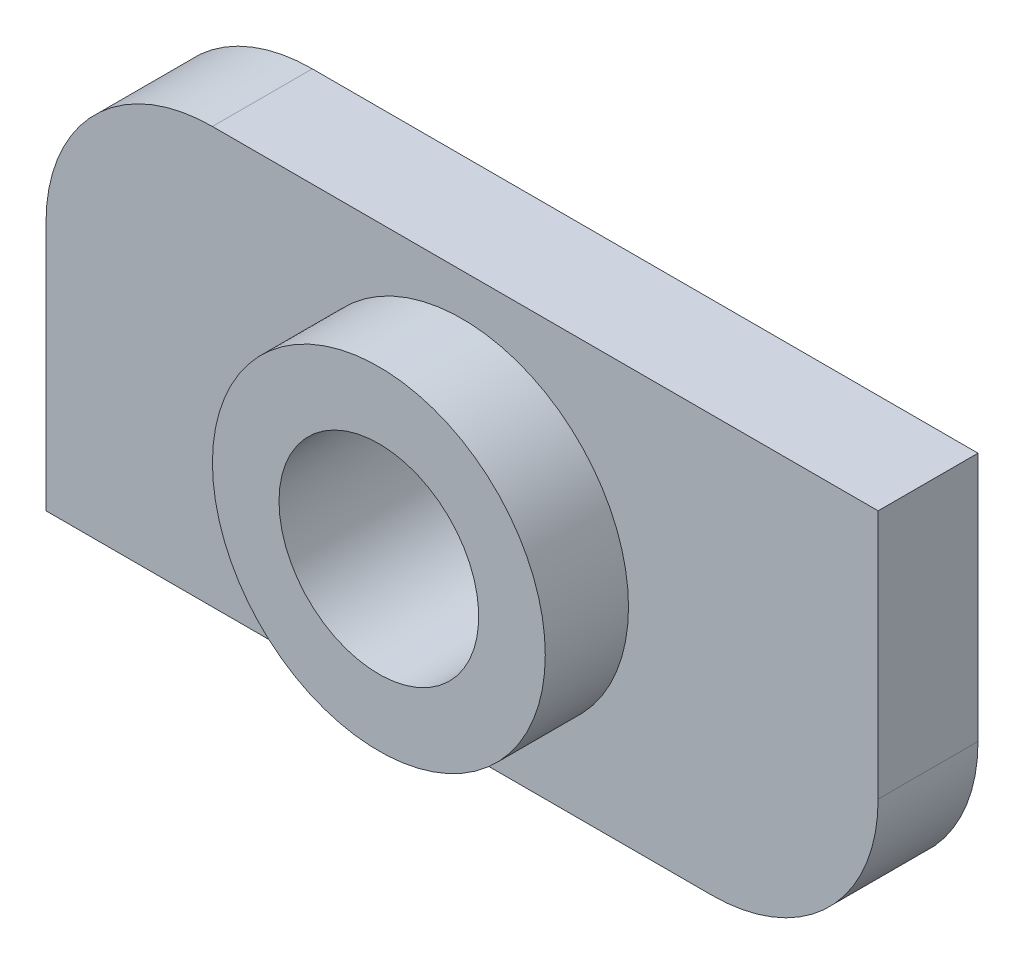
ISO-10303-21;
HEADER;
FILE_DESCRIPTION(('STEP AP214'),'2;1');
FILE_NAME('part.step','',(''),(''),'','','');
FILE_SCHEMA(('AUTOMOTIVE_DESIGN { 1 0 10303 214 1 1 1 1 }'));
ENDSEC;
DATA;
#1=APPLICATION_CONTEXT('core data for automotive mechanical design processes');
#2=APPLICATION_PROTOCOL_DEFINITION('international standard','automotive_design',2000,#1);
#3=PRODUCT_CONTEXT('',#1,'mechanical');
#4=PRODUCT('Part','Part','',(#3));
#5=PRODUCT_RELATED_PRODUCT_CATEGORY('part','',(#4));
#6=PRODUCT_DEFINITION_FORMATION('','',#4);
#7=PRODUCT_DEFINITION_CONTEXT('part definition',#1,'design');
#8=PRODUCT_DEFINITION('design','',#6,#7);
#9=PRODUCT_DEFINITION_SHAPE('','',#8);
#10=(LENGTH_UNIT() NAMED_UNIT(*) SI_UNIT(.MILLI.,.METRE.));
#11=(NAMED_UNIT(*) PLANE_ANGLE_UNIT() SI_UNIT($,.RADIAN.));
#12=(NAMED_UNIT(*) SI_UNIT($,.STERADIAN.) SOLID_ANGLE_UNIT());
#13=UNCERTAINTY_MEASURE_WITH_UNIT(LENGTH_MEASURE(1.E-05),#10,'distance_accuracy_value','');
#14=(GEOMETRIC_REPRESENTATION_CONTEXT(3) GLOBAL_UNCERTAINTY_ASSIGNED_CONTEXT((#13)) GLOBAL_UNIT_ASSIGNED_CONTEXT((#10,
#11,#12)) REPRESENTATION_CONTEXT('',''));
#15=CARTESIAN_POINT('',(0.,0.,0.));
#16=DIRECTION('',(0.,0.,1.));
#17=DIRECTION('',(1.,0.,0.));
#18=AXIS2_PLACEMENT_3D('',#15,#16,#17);
#19=CARTESIAN_POINT('',(0.,0.,2.2));
#20=DIRECTION('',(0.,0.,-1.));
#21=DIRECTION('',(-1.,0.,0.));
#22=AXIS2_PLACEMENT_3D('',#19,#20,#21);
#23=CYLINDRICAL_SURFACE('',#22,2.);
#24=CARTESIAN_POINT('',(0.,0.,2.2));
#25=DIRECTION('',(0.,0.,-1.));
#26=DIRECTION('',(-1.,0.,0.));
#27=AXIS2_PLACEMENT_3D('',#24,#25,#26);
#28=CIRCLE('',#27,2.);
#29=CARTESIAN_POINT('',(-2.,0.,2.2));
#30=VERTEX_POINT('',#29);
#31=EDGE_CURVE('E20',#30,#30,#28,.F.);
#32=ORIENTED_EDGE('',*,*,#31,.F.);
#33=EDGE_LOOP('',(#32));
#34=FACE_BOUND('',#33,.T.);
#35=CARTESIAN_POINT('',(0.,0.,1.2));
#36=DIRECTION('',(0.,0.,-1.));
#37=DIRECTION('',(-1.,0.,0.));
#38=AXIS2_PLACEMENT_3D('',#35,#36,#37);
#39=CIRCLE('',#38,2.);
#40=CARTESIAN_POINT('',(-2.,0.,1.2));
#41=VERTEX_POINT('',#40);
#42=EDGE_CURVE('E129',#41,#41,#39,.T.);
#43=ORIENTED_EDGE('',*,*,#42,.F.);
#44=EDGE_LOOP('',(#43));
#45=FACE_BOUND('',#44,.T.);
#46=ADVANCED_FACE('F17',(#34,#45),#23,.T.);
#47=CARTESIAN_POINT('',(0.,0.,2.2));
#48=DIRECTION('',(0.,0.,1.));
#49=DIRECTION('',(1.,0.,0.));
#50=AXIS2_PLACEMENT_3D('',#47,#48,#49);
#51=PLANE('',#50);
#52=ORIENTED_EDGE('',*,*,#31,.T.);
#53=EDGE_LOOP('',(#52));
#54=FACE_BOUND('',#53,.T.);
#55=CARTESIAN_POINT('',(0.,0.,2.2));
#56=DIRECTION('',(0.,0.,-1.));
#57=DIRECTION('',(-1.,0.,0.));
#58=AXIS2_PLACEMENT_3D('',#55,#56,#57);
#59=CIRCLE('',#58,1.2);
#60=CARTESIAN_POINT('',(-1.2,0.,2.2));
#61=VERTEX_POINT('',#60);
#62=EDGE_CURVE('E86',#61,#61,#59,.T.);
#63=ORIENTED_EDGE('',*,*,#62,.T.);
#64=EDGE_LOOP('',(#63));
#65=FACE_BOUND('',#64,.T.);
#66=ADVANCED_FACE('F135',(#54,#65),#51,.T.);
#67=CARTESIAN_POINT('',(-5.,-2.5,1.2));
#68=DIRECTION('',(0.,0.,1.));
#69=DIRECTION('',(1.,0.,0.));
#70=AXIS2_PLACEMENT_3D('',#67,#68,#69);
#71=PLANE('',#70);
#72=DIRECTION('',(0.,-1.,0.));
#73=VECTOR('',#72,1.);
#74=CARTESIAN_POINT('',(5.,2.5,1.2));
#75=LINE('',#74,#73);
#76=CARTESIAN_POINT('',(5.,-0.5,1.2));
#77=VERTEX_POINT('',#76);
#78=CARTESIAN_POINT('',(5.,2.5,1.2));
#79=VERTEX_POINT('',#78);
#80=EDGE_CURVE('E73',#77,#79,#75,.F.);
#81=ORIENTED_EDGE('',*,*,#80,.T.);
#82=DIRECTION('',(1.,0.,0.));
#83=VECTOR('',#82,1.);
#84=CARTESIAN_POINT('',(-5.,2.5,1.2));
#85=LINE('',#84,#83);
#86=CARTESIAN_POINT('',(-3.,2.5,1.2));
#87=VERTEX_POINT('',#86);
#88=EDGE_CURVE('E77',#79,#87,#85,.F.);
#89=ORIENTED_EDGE('',*,*,#88,.T.);
#90=CARTESIAN_POINT('',(-3.,0.5,1.2));
#91=DIRECTION('',(0.,0.,-1.));
#92=DIRECTION('',(-1.,0.,0.));
#93=AXIS2_PLACEMENT_3D('',#90,#91,#92);
#94=CIRCLE('',#93,2.);
#95=CARTESIAN_POINT('',(-5.,0.499999999999999,1.2));
#96=VERTEX_POINT('',#95);
#97=EDGE_CURVE('E68',#96,#87,#94,.T.);
#98=ORIENTED_EDGE('',*,*,#97,.F.);
#99=DIRECTION('',(0.,1.,0.));
#100=VECTOR('',#99,1.);
#101=CARTESIAN_POINT('',(-5.,2.5,1.2));
#102=LINE('',#101,#100);
#103=CARTESIAN_POINT('',(-5.,-2.5,1.2));
#104=VERTEX_POINT('',#103);
#105=EDGE_CURVE('E62',#96,#104,#102,.F.);
#106=ORIENTED_EDGE('',*,*,#105,.T.);
#107=DIRECTION('',(1.,0.,0.));
#108=VECTOR('',#107,1.);
#109=CARTESIAN_POINT('',(-5.,-2.5,1.2));
#110=LINE('',#109,#108);
#111=CARTESIAN_POINT('',(3.,-2.5,1.2));
#112=VERTEX_POINT('',#111);
#113=EDGE_CURVE('E104',#104,#112,#110,.T.);
#114=ORIENTED_EDGE('',*,*,#113,.T.);
#115=CARTESIAN_POINT('',(3.,-0.5,1.2));
#116=DIRECTION('',(0.,0.,-1.));
#117=DIRECTION('',(-1.,0.,0.));
#118=AXIS2_PLACEMENT_3D('',#115,#116,#117);
#119=CIRCLE('',#118,2.);
#120=EDGE_CURVE('E80',#77,#112,#119,.T.);
#121=ORIENTED_EDGE('',*,*,#120,.F.);
#122=EDGE_LOOP('',(#81,#89,#98,#106,#114,#121));
#123=FACE_BOUND('',#122,.T.);
#124=ORIENTED_EDGE('',*,*,#42,.T.);
#125=EDGE_LOOP('',(#124));
#126=FACE_BOUND('',#125,.T.);
#127=ADVANCED_FACE('F75',(#123,#126),#71,.T.);
#128=CARTESIAN_POINT('',(0.,0.,1.2));
#129=DIRECTION('',(0.,0.,-1.));
#130=DIRECTION('',(-1.,0.,0.));
#131=AXIS2_PLACEMENT_3D('',#128,#129,#130);
#132=CYLINDRICAL_SURFACE('',#131,1.2);
#133=ORIENTED_EDGE('',*,*,#62,.F.);
#134=EDGE_LOOP('',(#133));
#135=FACE_BOUND('',#134,.T.);
#136=CARTESIAN_POINT('',(0.,0.,0.));
#137=DIRECTION('',(0.,0.,-1.));
#138=DIRECTION('',(-1.,0.,0.));
#139=AXIS2_PLACEMENT_3D('',#136,#137,#138);
#140=CIRCLE('',#139,1.2);
#141=CARTESIAN_POINT('',(-1.2,0.,0.));
#142=VERTEX_POINT('',#141);
#143=EDGE_CURVE('E123',#142,#142,#140,.T.);
#144=ORIENTED_EDGE('',*,*,#143,.T.);
#145=EDGE_LOOP('',(#144));
#146=FACE_BOUND('',#145,.T.);
#147=ADVANCED_FACE('F170',(#135,#146),#132,.F.);
#148=CARTESIAN_POINT('',(5.,2.5,1.2));
#149=DIRECTION('',(-1.,0.,0.));
#150=DIRECTION('',(0.,-1.,0.));
#151=AXIS2_PLACEMENT_3D('',#148,#149,#150);
#152=PLANE('',#151);
#153=DIRECTION('',(0.,1.,0.));
#154=VECTOR('',#153,1.);
#155=CARTESIAN_POINT('',(5.,-2.5,0.));
#156=LINE('',#155,#154);
#157=CARTESIAN_POINT('',(5.,-0.5,0.));
#158=VERTEX_POINT('',#157);
#159=CARTESIAN_POINT('',(5.,2.5,0.));
#160=VERTEX_POINT('',#159);
#161=EDGE_CURVE('E97',#158,#160,#156,.T.);
#162=ORIENTED_EDGE('',*,*,#161,.T.);
#163=DIRECTION('',(0.,0.,1.));
#164=VECTOR('',#163,1.);
#165=CARTESIAN_POINT('',(5.,2.5,1.2));
#166=LINE('',#165,#164);
#167=EDGE_CURVE('E85',#160,#79,#166,.T.);
#168=ORIENTED_EDGE('',*,*,#167,.T.);
#169=ORIENTED_EDGE('',*,*,#80,.F.);
#170=DIRECTION('',(0.,0.,-1.));
#171=VECTOR('',#170,1.);
#172=CARTESIAN_POINT('',(5.,-0.5,1.2));
#173=LINE('',#172,#171);
#174=EDGE_CURVE('E106',#158,#77,#173,.F.);
#175=ORIENTED_EDGE('',*,*,#174,.F.);
#176=EDGE_LOOP('',(#162,#168,#169,#175));
#177=FACE_BOUND('',#176,.T.);
#178=ADVANCED_FACE('F96',(#177),#152,.F.);
#179=CARTESIAN_POINT('',(-5.,2.5,1.2));
#180=DIRECTION('',(0.,-1.,0.));
#181=DIRECTION('',(1.,0.,0.));
#182=AXIS2_PLACEMENT_3D('',#179,#180,#181);
#183=PLANE('',#182);
#184=ORIENTED_EDGE('',*,*,#88,.F.);
#185=ORIENTED_EDGE('',*,*,#167,.F.);
#186=DIRECTION('',(1.,0.,0.));
#187=VECTOR('',#186,1.);
#188=CARTESIAN_POINT('',(-5.,2.5,0.));
#189=LINE('',#188,#187);
#190=CARTESIAN_POINT('',(-3.,2.5,0.));
#191=VERTEX_POINT('',#190);
#192=EDGE_CURVE('E122',#160,#191,#189,.F.);
#193=ORIENTED_EDGE('',*,*,#192,.T.);
#194=DIRECTION('',(0.,0.,-1.));
#195=VECTOR('',#194,1.);
#196=CARTESIAN_POINT('',(-3.,2.5,1.2));
#197=LINE('',#196,#195);
#198=EDGE_CURVE('E93',#87,#191,#197,.T.);
#199=ORIENTED_EDGE('',*,*,#198,.F.);
#200=EDGE_LOOP('',(#184,#185,#193,#199));
#201=FACE_BOUND('',#200,.T.);
#202=ADVANCED_FACE('F90',(#201),#183,.F.);
#203=CARTESIAN_POINT('',(-3.,0.5,1.2));
#204=DIRECTION('',(0.,0.,-1.));
#205=DIRECTION('',(-1.,0.,0.));
#206=AXIS2_PLACEMENT_3D('',#203,#204,#205);
#207=CYLINDRICAL_SURFACE('',#206,2.);
#208=ORIENTED_EDGE('',*,*,#97,.T.);
#209=ORIENTED_EDGE('',*,*,#198,.T.);
#210=CARTESIAN_POINT('',(-3.,0.5,0.));
#211=DIRECTION('',(0.,0.,-1.));
#212=DIRECTION('',(-1.,0.,0.));
#213=AXIS2_PLACEMENT_3D('',#210,#211,#212);
#214=CIRCLE('',#213,2.);
#215=CARTESIAN_POINT('',(-5.,0.5,0.));
#216=VERTEX_POINT('',#215);
#217=EDGE_CURVE('E118',#191,#216,#214,.F.);
#218=ORIENTED_EDGE('',*,*,#217,.T.);
#219=DIRECTION('',(0.,0.,1.));
#220=VECTOR('',#219,1.);
#221=CARTESIAN_POINT('',(-5.,0.5,1.2));
#222=LINE('',#221,#220);
#223=EDGE_CURVE('E113',#216,#96,#222,.T.);
#224=ORIENTED_EDGE('',*,*,#223,.T.);
#225=EDGE_LOOP('',(#208,#209,#218,#224));
#226=FACE_BOUND('',#225,.T.);
#227=ADVANCED_FACE('F163',(#226),#207,.T.);
#228=CARTESIAN_POINT('',(-5.,2.5,1.2));
#229=DIRECTION('',(1.,0.,0.));
#230=DIRECTION('',(0.,1.,0.));
#231=AXIS2_PLACEMENT_3D('',#228,#229,#230);
#232=PLANE('',#231);
#233=DIRECTION('',(0.,1.,0.));
#234=VECTOR('',#233,1.);
#235=CARTESIAN_POINT('',(-5.,-2.5,0.));
#236=LINE('',#235,#234);
#237=CARTESIAN_POINT('',(-5.,-2.5,0.));
#238=VERTEX_POINT('',#237);
#239=EDGE_CURVE('E121',#216,#238,#236,.F.);
#240=ORIENTED_EDGE('',*,*,#239,.T.);
#241=DIRECTION('',(0.,0.,1.));
#242=VECTOR('',#241,1.);
#243=CARTESIAN_POINT('',(-5.,-2.5,1.2));
#244=LINE('',#243,#242);
#245=EDGE_CURVE('E107',#238,#104,#244,.T.);
#246=ORIENTED_EDGE('',*,*,#245,.T.);
#247=ORIENTED_EDGE('',*,*,#105,.F.);
#248=ORIENTED_EDGE('',*,*,#223,.F.);
#249=EDGE_LOOP('',(#240,#246,#247,#248));
#250=FACE_BOUND('',#249,.T.);
#251=ADVANCED_FACE('F159',(#250),#232,.F.);
#252=CARTESIAN_POINT('',(-5.,-2.5,1.2));
#253=DIRECTION('',(0.,1.,0.));
#254=DIRECTION('',(0.,0.,1.));
#255=AXIS2_PLACEMENT_3D('',#252,#253,#254);
#256=PLANE('',#255);
#257=ORIENTED_EDGE('',*,*,#113,.F.);
#258=ORIENTED_EDGE('',*,*,#245,.F.);
#259=DIRECTION('',(1.,0.,0.));
#260=VECTOR('',#259,1.);
#261=CARTESIAN_POINT('',(-5.,-2.5,0.));
#262=LINE('',#261,#260);
#263=CARTESIAN_POINT('',(3.,-2.5,0.));
#264=VERTEX_POINT('',#263);
#265=EDGE_CURVE('E26',#238,#264,#262,.T.);
#266=ORIENTED_EDGE('',*,*,#265,.T.);
#267=DIRECTION('',(0.,0.,-1.));
#268=VECTOR('',#267,1.);
#269=CARTESIAN_POINT('',(3.,-2.5,1.2));
#270=LINE('',#269,#268);
#271=EDGE_CURVE('E34',#112,#264,#270,.T.);
#272=ORIENTED_EDGE('',*,*,#271,.F.);
#273=EDGE_LOOP('',(#257,#258,#266,#272));
#274=FACE_BOUND('',#273,.T.);
#275=ADVANCED_FACE('F152',(#274),#256,.F.);
#276=CARTESIAN_POINT('',(3.,-0.5,1.2));
#277=DIRECTION('',(0.,0.,-1.));
#278=DIRECTION('',(-1.,0.,0.));
#279=AXIS2_PLACEMENT_3D('',#276,#277,#278);
#280=CYLINDRICAL_SURFACE('',#279,2.);
#281=ORIENTED_EDGE('',*,*,#120,.T.);
#282=ORIENTED_EDGE('',*,*,#271,.T.);
#283=CARTESIAN_POINT('',(3.,-0.5,0.));
#284=DIRECTION('',(0.,0.,-1.));
#285=DIRECTION('',(-1.,0.,0.));
#286=AXIS2_PLACEMENT_3D('',#283,#284,#285);
#287=CIRCLE('',#286,2.);
#288=EDGE_CURVE('E11',#264,#158,#287,.F.);
#289=ORIENTED_EDGE('',*,*,#288,.T.);
#290=ORIENTED_EDGE('',*,*,#174,.T.);
#291=EDGE_LOOP('',(#281,#282,#289,#290));
#292=FACE_BOUND('',#291,.T.);
#293=ADVANCED_FACE('F146',(#292),#280,.T.);
#294=CARTESIAN_POINT('',(-5.,-2.5,0.));
#295=DIRECTION('',(0.,0.,1.));
#296=DIRECTION('',(1.,0.,0.));
#297=AXIS2_PLACEMENT_3D('',#294,#295,#296);
#298=PLANE('',#297);
#299=ORIENTED_EDGE('',*,*,#265,.F.);
#300=ORIENTED_EDGE('',*,*,#239,.F.);
#301=ORIENTED_EDGE('',*,*,#217,.F.);
#302=ORIENTED_EDGE('',*,*,#192,.F.);
#303=ORIENTED_EDGE('',*,*,#161,.F.);
#304=ORIENTED_EDGE('',*,*,#288,.F.);
#305=EDGE_LOOP('',(#299,#300,#301,#302,#303,#304));
#306=FACE_BOUND('',#305,.T.);
#307=ORIENTED_EDGE('',*,*,#143,.F.);
#308=EDGE_LOOP('',(#307));
#309=FACE_BOUND('',#308,.T.);
#310=ADVANCED_FACE('F144',(#306,#309),#298,.F.);
#311=CLOSED_SHELL('',(#46,#66,#127,#147,#178,#202,#227,#251,#275,#293,#310));
#312=MANIFOLD_SOLID_BREP('B1',#311);
#313=ADVANCED_BREP_SHAPE_REPRESENTATION('',(#18,#312),#14);
#314=SHAPE_DEFINITION_REPRESENTATION(#9,#313);
ENDSEC;
END-ISO-10303-21;
